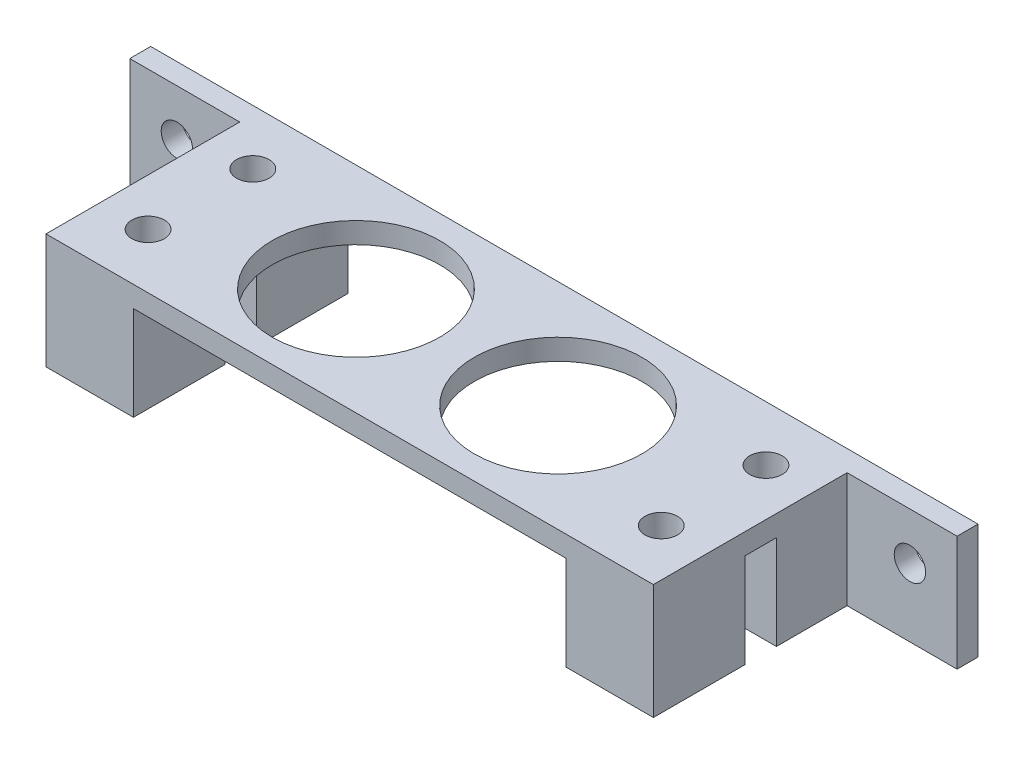
ISO-10303-21;
HEADER;
FILE_DESCRIPTION(('STEP AP214'),'2;1');
FILE_NAME('part.step','',(''),(''),'','','');
FILE_SCHEMA(('AUTOMOTIVE_DESIGN { 1 0 10303 214 1 1 1 1 }'));
ENDSEC;
DATA;
#1=APPLICATION_CONTEXT('core data for automotive mechanical design processes');
#2=APPLICATION_PROTOCOL_DEFINITION('international standard','automotive_design',2000,#1);
#3=PRODUCT_CONTEXT('',#1,'mechanical');
#4=PRODUCT('Part','Part','',(#3));
#5=PRODUCT_RELATED_PRODUCT_CATEGORY('part','',(#4));
#6=PRODUCT_DEFINITION_FORMATION('','',#4);
#7=PRODUCT_DEFINITION_CONTEXT('part definition',#1,'design');
#8=PRODUCT_DEFINITION('design','',#6,#7);
#9=PRODUCT_DEFINITION_SHAPE('','',#8);
#10=(LENGTH_UNIT() NAMED_UNIT(*) SI_UNIT(.MILLI.,.METRE.));
#11=(NAMED_UNIT(*) PLANE_ANGLE_UNIT() SI_UNIT($,.RADIAN.));
#12=(NAMED_UNIT(*) SI_UNIT($,.STERADIAN.) SOLID_ANGLE_UNIT());
#13=UNCERTAINTY_MEASURE_WITH_UNIT(LENGTH_MEASURE(1.E-05),#10,'distance_accuracy_value','');
#14=(GEOMETRIC_REPRESENTATION_CONTEXT(3) GLOBAL_UNCERTAINTY_ASSIGNED_CONTEXT((#13)) GLOBAL_UNIT_ASSIGNED_CONTEXT((#10,
#11,#12)) REPRESENTATION_CONTEXT('',''));
#15=CARTESIAN_POINT('',(0.,0.,0.));
#16=DIRECTION('',(0.,0.,1.));
#17=DIRECTION('',(1.,0.,0.));
#18=AXIS2_PLACEMENT_3D('',#15,#16,#17);
#19=CARTESIAN_POINT('',(-29.,2.,0.));
#20=DIRECTION('',(1.,0.,0.));
#21=DIRECTION('',(0.,0.,-1.));
#22=AXIS2_PLACEMENT_3D('',#19,#20,#21);
#23=PLANE('',#22);
#24=DIRECTION('',(0.,1.,0.));
#25=VECTOR('',#24,1.);
#26=CARTESIAN_POINT('',(-29.,0.,-8.25));
#27=LINE('',#26,#25);
#28=CARTESIAN_POINT('',(-29.,-9.,-8.25));
#29=VERTEX_POINT('',#28);
#30=CARTESIAN_POINT('',(-29.,2.,-8.25));
#31=VERTEX_POINT('',#30);
#32=EDGE_CURVE('E58',#29,#31,#27,.T.);
#33=ORIENTED_EDGE('',*,*,#32,.F.);
#34=DIRECTION('',(0.,0.,-1.));
#35=VECTOR('',#34,1.);
#36=CARTESIAN_POINT('',(-29.,-9.,0.));
#37=LINE('',#36,#35);
#38=CARTESIAN_POINT('',(-29.,-9.,-1.5));
#39=VERTEX_POINT('',#38);
#40=EDGE_CURVE('E338',#39,#29,#37,.T.);
#41=ORIENTED_EDGE('',*,*,#40,.F.);
#42=DIRECTION('',(0.,1.,0.));
#43=VECTOR('',#42,1.);
#44=CARTESIAN_POINT('',(-29.,-9.,-1.5));
#45=LINE('',#44,#43);
#46=CARTESIAN_POINT('',(-29.,0.,-1.5));
#47=VERTEX_POINT('',#46);
#48=EDGE_CURVE('E365',#39,#47,#45,.T.);
#49=ORIENTED_EDGE('',*,*,#48,.T.);
#50=DIRECTION('',(0.,0.,1.));
#51=VECTOR('',#50,1.);
#52=CARTESIAN_POINT('',(-29.,0.,0.));
#53=LINE('',#52,#51);
#54=CARTESIAN_POINT('',(-29.,0.,1.5));
#55=VERTEX_POINT('',#54);
#56=EDGE_CURVE('E452',#47,#55,#53,.T.);
#57=ORIENTED_EDGE('',*,*,#56,.T.);
#58=DIRECTION('',(0.,1.,0.));
#59=VECTOR('',#58,1.);
#60=CARTESIAN_POINT('',(-29.,-9.,1.5));
#61=LINE('',#60,#59);
#62=CARTESIAN_POINT('',(-29.,-9.,1.5));
#63=VERTEX_POINT('',#62);
#64=EDGE_CURVE('E402',#63,#55,#61,.T.);
#65=ORIENTED_EDGE('',*,*,#64,.F.);
#66=DIRECTION('',(0.,0.,-1.));
#67=VECTOR('',#66,1.);
#68=CARTESIAN_POINT('',(-29.,-9.,0.));
#69=LINE('',#68,#67);
#70=CARTESIAN_POINT('',(-29.,-9.,10.25));
#71=VERTEX_POINT('',#70);
#72=EDGE_CURVE('E373',#71,#63,#69,.T.);
#73=ORIENTED_EDGE('',*,*,#72,.F.);
#74=DIRECTION('',(0.,-1.,0.));
#75=VECTOR('',#74,1.);
#76=CARTESIAN_POINT('',(-29.,2.,10.25));
#77=LINE('',#76,#75);
#78=CARTESIAN_POINT('',(-29.,2.,10.25));
#79=VERTEX_POINT('',#78);
#80=EDGE_CURVE('E11',#79,#71,#77,.T.);
#81=ORIENTED_EDGE('',*,*,#80,.F.);
#82=DIRECTION('',(0.,0.,1.));
#83=VECTOR('',#82,1.);
#84=CARTESIAN_POINT('',(-29.,2.,0.));
#85=LINE('',#84,#83);
#86=EDGE_CURVE('E178',#31,#79,#85,.T.);
#87=ORIENTED_EDGE('',*,*,#86,.F.);
#88=EDGE_LOOP('',(#33,#41,#49,#57,#65,#73,#81,#87));
#89=FACE_BOUND('',#88,.T.);
#90=ADVANCED_FACE('F42',(#89),#23,.F.);
#91=CARTESIAN_POINT('',(0.,0.,0.));
#92=DIRECTION('',(0.,1.,0.));
#93=DIRECTION('',(0.,0.,1.));
#94=AXIS2_PLACEMENT_3D('',#91,#92,#93);
#95=PLANE('',#94);
#96=CARTESIAN_POINT('',(-9.65,0.,0.));
#97=DIRECTION('',(0.,1.,0.));
#98=DIRECTION('',(0.,0.,1.));
#99=AXIS2_PLACEMENT_3D('',#96,#97,#98);
#100=CIRCLE('',#99,8.);
#101=CARTESIAN_POINT('',(-9.65,0.,8.));
#102=VERTEX_POINT('',#101);
#103=EDGE_CURVE('E442',#102,#102,#100,.T.);
#104=ORIENTED_EDGE('',*,*,#103,.T.);
#105=EDGE_LOOP('',(#104));
#106=FACE_BOUND('',#105,.T.);
#107=CARTESIAN_POINT('',(9.65,0.,0.));
#108=DIRECTION('',(0.,1.,0.));
#109=DIRECTION('',(0.,0.,1.));
#110=AXIS2_PLACEMENT_3D('',#107,#108,#109);
#111=CIRCLE('',#110,8.);
#112=CARTESIAN_POINT('',(9.65,0.,8.));
#113=VERTEX_POINT('',#112);
#114=EDGE_CURVE('E406',#113,#113,#111,.T.);
#115=ORIENTED_EDGE('',*,*,#114,.T.);
#116=EDGE_LOOP('',(#115));
#117=FACE_BOUND('',#116,.T.);
#118=DIRECTION('',(0.,0.,-1.));
#119=VECTOR('',#118,1.);
#120=CARTESIAN_POINT('',(20.65,0.,0.));
#121=LINE('',#120,#119);
#122=CARTESIAN_POINT('',(20.65,0.,-1.5));
#123=VERTEX_POINT('',#122);
#124=CARTESIAN_POINT('',(20.65,0.,-10.25));
#125=VERTEX_POINT('',#124);
#126=EDGE_CURVE('E267',#123,#125,#121,.T.);
#127=ORIENTED_EDGE('',*,*,#126,.F.);
#128=DIRECTION('',(1.,0.,0.));
#129=VECTOR('',#128,1.);
#130=CARTESIAN_POINT('',(0.,0.,-1.5));
#131=LINE('',#130,#129);
#132=CARTESIAN_POINT('',(29.,0.,-1.5));
#133=VERTEX_POINT('',#132);
#134=EDGE_CURVE('E258',#123,#133,#131,.T.);
#135=ORIENTED_EDGE('',*,*,#134,.T.);
#136=DIRECTION('',(0.,0.,1.));
#137=VECTOR('',#136,1.);
#138=CARTESIAN_POINT('',(29.,0.,0.));
#139=LINE('',#138,#137);
#140=CARTESIAN_POINT('',(29.,0.,1.5));
#141=VERTEX_POINT('',#140);
#142=EDGE_CURVE('E446',#133,#141,#139,.T.);
#143=ORIENTED_EDGE('',*,*,#142,.T.);
#144=DIRECTION('',(1.,0.,0.));
#145=VECTOR('',#144,1.);
#146=CARTESIAN_POINT('',(0.,0.,1.5));
#147=LINE('',#146,#145);
#148=CARTESIAN_POINT('',(20.65,0.,1.5));
#149=VERTEX_POINT('',#148);
#150=EDGE_CURVE('E303',#149,#141,#147,.T.);
#151=ORIENTED_EDGE('',*,*,#150,.F.);
#152=DIRECTION('',(0.,0.,-1.));
#153=VECTOR('',#152,1.);
#154=CARTESIAN_POINT('',(20.65,0.,0.));
#155=LINE('',#154,#153);
#156=CARTESIAN_POINT('',(20.65,0.,10.25));
#157=VERTEX_POINT('',#156);
#158=EDGE_CURVE('E297',#157,#149,#155,.T.);
#159=ORIENTED_EDGE('',*,*,#158,.F.);
#160=DIRECTION('',(1.,0.,0.));
#161=VECTOR('',#160,1.);
#162=CARTESIAN_POINT('',(0.,0.,10.25));
#163=LINE('',#162,#161);
#164=CARTESIAN_POINT('',(-20.65,0.,10.25));
#165=VERTEX_POINT('',#164);
#166=EDGE_CURVE('E412',#165,#157,#163,.T.);
#167=ORIENTED_EDGE('',*,*,#166,.F.);
#168=DIRECTION('',(0.,0.,-1.));
#169=VECTOR('',#168,1.);
#170=CARTESIAN_POINT('',(-20.65,0.,0.));
#171=LINE('',#170,#169);
#172=CARTESIAN_POINT('',(-20.65,0.,1.5));
#173=VERTEX_POINT('',#172);
#174=EDGE_CURVE('E374',#165,#173,#171,.T.);
#175=ORIENTED_EDGE('',*,*,#174,.T.);
#176=DIRECTION('',(1.,0.,0.));
#177=VECTOR('',#176,1.);
#178=CARTESIAN_POINT('',(0.,0.,1.5));
#179=LINE('',#178,#177);
#180=EDGE_CURVE('E368',#55,#173,#179,.T.);
#181=ORIENTED_EDGE('',*,*,#180,.F.);
#182=ORIENTED_EDGE('',*,*,#56,.F.);
#183=DIRECTION('',(1.,0.,0.));
#184=VECTOR('',#183,1.);
#185=CARTESIAN_POINT('',(0.,0.,-1.5));
#186=LINE('',#185,#184);
#187=CARTESIAN_POINT('',(-20.65,0.,-1.5));
#188=VERTEX_POINT('',#187);
#189=EDGE_CURVE('E333',#47,#188,#186,.T.);
#190=ORIENTED_EDGE('',*,*,#189,.T.);
#191=DIRECTION('',(0.,0.,-1.));
#192=VECTOR('',#191,1.);
#193=CARTESIAN_POINT('',(-20.65,0.,0.));
#194=LINE('',#193,#192);
#195=CARTESIAN_POINT('',(-20.65,0.,-10.25));
#196=VERTEX_POINT('',#195);
#197=EDGE_CURVE('E339',#188,#196,#194,.T.);
#198=ORIENTED_EDGE('',*,*,#197,.T.);
#199=DIRECTION('',(1.,0.,0.));
#200=VECTOR('',#199,1.);
#201=CARTESIAN_POINT('',(0.,0.,-10.25));
#202=LINE('',#201,#200);
#203=EDGE_CURVE('E449',#196,#125,#202,.T.);
#204=ORIENTED_EDGE('',*,*,#203,.T.);
#205=EDGE_LOOP('',(#127,#135,#143,#151,#159,#167,#175,#181,#182,#190,#198,#204));
#206=FACE_BOUND('',#205,.T.);
#207=ADVANCED_FACE('F508',(#106,#117,#206),#95,.F.);
#208=CARTESIAN_POINT('',(29.,2.,0.));
#209=DIRECTION('',(1.,0.,0.));
#210=DIRECTION('',(0.,0.,-1.));
#211=AXIS2_PLACEMENT_3D('',#208,#209,#210);
#212=PLANE('',#211);
#213=DIRECTION('',(0.,-1.,0.));
#214=VECTOR('',#213,1.);
#215=CARTESIAN_POINT('',(29.,0.,-8.25));
#216=LINE('',#215,#214);
#217=CARTESIAN_POINT('',(29.,2.,-8.25));
#218=VERTEX_POINT('',#217);
#219=CARTESIAN_POINT('',(29.,-9.,-8.25));
#220=VERTEX_POINT('',#219);
#221=EDGE_CURVE('E66',#218,#220,#216,.T.);
#222=ORIENTED_EDGE('',*,*,#221,.F.);
#223=DIRECTION('',(0.,0.,1.));
#224=VECTOR('',#223,1.);
#225=CARTESIAN_POINT('',(29.,2.,0.));
#226=LINE('',#225,#224);
#227=CARTESIAN_POINT('',(29.,2.,10.25));
#228=VERTEX_POINT('',#227);
#229=EDGE_CURVE('E432',#218,#228,#226,.T.);
#230=ORIENTED_EDGE('',*,*,#229,.T.);
#231=DIRECTION('',(0.,-1.,0.));
#232=VECTOR('',#231,1.);
#233=CARTESIAN_POINT('',(29.,2.,10.25));
#234=LINE('',#233,#232);
#235=CARTESIAN_POINT('',(29.,-9.,10.25));
#236=VERTEX_POINT('',#235);
#237=EDGE_CURVE('E51',#228,#236,#234,.T.);
#238=ORIENTED_EDGE('',*,*,#237,.T.);
#239=DIRECTION('',(0.,0.,1.));
#240=VECTOR('',#239,1.);
#241=CARTESIAN_POINT('',(29.,-9.,0.));
#242=LINE('',#241,#240);
#243=CARTESIAN_POINT('',(29.,-9.,1.5));
#244=VERTEX_POINT('',#243);
#245=EDGE_CURVE('E310',#244,#236,#242,.T.);
#246=ORIENTED_EDGE('',*,*,#245,.F.);
#247=DIRECTION('',(0.,1.,0.));
#248=VECTOR('',#247,1.);
#249=CARTESIAN_POINT('',(29.,-9.,1.5));
#250=LINE('',#249,#248);
#251=EDGE_CURVE('E326',#244,#141,#250,.T.);
#252=ORIENTED_EDGE('',*,*,#251,.T.);
#253=ORIENTED_EDGE('',*,*,#142,.F.);
#254=DIRECTION('',(0.,1.,0.));
#255=VECTOR('',#254,1.);
#256=CARTESIAN_POINT('',(29.,-9.,-1.5));
#257=LINE('',#256,#255);
#258=CARTESIAN_POINT('',(29.,-9.,-1.5));
#259=VERTEX_POINT('',#258);
#260=EDGE_CURVE('E280',#259,#133,#257,.T.);
#261=ORIENTED_EDGE('',*,*,#260,.F.);
#262=DIRECTION('',(0.,0.,1.));
#263=VECTOR('',#262,1.);
#264=CARTESIAN_POINT('',(29.,-9.,0.));
#265=LINE('',#264,#263);
#266=EDGE_CURVE('E273',#220,#259,#265,.T.);
#267=ORIENTED_EDGE('',*,*,#266,.F.);
#268=EDGE_LOOP('',(#222,#230,#238,#246,#252,#253,#261,#267));
#269=FACE_BOUND('',#268,.T.);
#270=ADVANCED_FACE('F460',(#269),#212,.T.);
#271=CARTESIAN_POINT('',(0.,2.,-10.25));
#272=DIRECTION('',(0.,0.,-1.));
#273=DIRECTION('',(-1.,0.,0.));
#274=AXIS2_PLACEMENT_3D('',#271,#272,#273);
#275=PLANE('',#274);
#276=ORIENTED_EDGE('',*,*,#203,.F.);
#277=DIRECTION('',(0.,1.,0.));
#278=VECTOR('',#277,1.);
#279=CARTESIAN_POINT('',(-20.65,-9.,-10.25));
#280=LINE('',#279,#278);
#281=CARTESIAN_POINT('',(-20.65,-9.,-10.25));
#282=VERTEX_POINT('',#281);
#283=EDGE_CURVE('E362',#282,#196,#280,.T.);
#284=ORIENTED_EDGE('',*,*,#283,.F.);
#285=DIRECTION('',(1.,0.,0.));
#286=VECTOR('',#285,1.);
#287=CARTESIAN_POINT('',(0.,-9.,-10.25));
#288=LINE('',#287,#286);
#289=CARTESIAN_POINT('',(-39.5,-9.,-10.25));
#290=VERTEX_POINT('',#289);
#291=EDGE_CURVE('E342',#290,#282,#288,.T.);
#292=ORIENTED_EDGE('',*,*,#291,.F.);
#293=DIRECTION('',(0.,-1.,0.));
#294=VECTOR('',#293,1.);
#295=CARTESIAN_POINT('',(-39.5,0.,-10.25));
#296=LINE('',#295,#294);
#297=CARTESIAN_POINT('',(-39.5,2.,-10.25));
#298=VERTEX_POINT('',#297);
#299=EDGE_CURVE('E207',#298,#290,#296,.T.);
#300=ORIENTED_EDGE('',*,*,#299,.F.);
#301=DIRECTION('',(1.,0.,0.));
#302=VECTOR('',#301,1.);
#303=CARTESIAN_POINT('',(0.,2.,-10.25));
#304=LINE('',#303,#302);
#305=CARTESIAN_POINT('',(39.5,2.,-10.25));
#306=VERTEX_POINT('',#305);
#307=EDGE_CURVE('E186',#298,#306,#304,.T.);
#308=ORIENTED_EDGE('',*,*,#307,.T.);
#309=DIRECTION('',(0.,-1.,0.));
#310=VECTOR('',#309,1.);
#311=CARTESIAN_POINT('',(39.5,0.,-10.25));
#312=LINE('',#311,#310);
#313=CARTESIAN_POINT('',(39.5,-9.00000000000002,-10.25));
#314=VERTEX_POINT('',#313);
#315=EDGE_CURVE('E234',#306,#314,#312,.T.);
#316=ORIENTED_EDGE('',*,*,#315,.T.);
#317=DIRECTION('',(1.,0.,0.));
#318=VECTOR('',#317,1.);
#319=CARTESIAN_POINT('',(0.,-9.,-10.25));
#320=LINE('',#319,#318);
#321=CARTESIAN_POINT('',(20.65,-9.,-10.25));
#322=VERTEX_POINT('',#321);
#323=EDGE_CURVE('E270',#322,#314,#320,.T.);
#324=ORIENTED_EDGE('',*,*,#323,.F.);
#325=DIRECTION('',(0.,1.,0.));
#326=VECTOR('',#325,1.);
#327=CARTESIAN_POINT('',(20.65,-9.,-10.25));
#328=LINE('',#327,#326);
#329=EDGE_CURVE('E289',#322,#125,#328,.T.);
#330=ORIENTED_EDGE('',*,*,#329,.T.);
#331=EDGE_LOOP('',(#276,#284,#292,#300,#308,#316,#324,#330));
#332=FACE_BOUND('',#331,.T.);
#333=CARTESIAN_POINT('',(35.,-2.5,-10.25));
#334=DIRECTION('',(0.,0.,-1.));
#335=DIRECTION('',(-1.,0.,0.));
#336=AXIS2_PLACEMENT_3D('',#333,#334,#335);
#337=CIRCLE('',#336,1.5);
#338=CARTESIAN_POINT('',(33.5,-2.5,-10.25));
#339=VERTEX_POINT('',#338);
#340=EDGE_CURVE('E225',#339,#339,#337,.T.);
#341=ORIENTED_EDGE('',*,*,#340,.F.);
#342=EDGE_LOOP('',(#341));
#343=FACE_BOUND('',#342,.T.);
#344=CARTESIAN_POINT('',(-35.,-2.5,-10.25));
#345=DIRECTION('',(0.,0.,-1.));
#346=DIRECTION('',(-1.,0.,0.));
#347=AXIS2_PLACEMENT_3D('',#344,#345,#346);
#348=CIRCLE('',#347,1.5);
#349=CARTESIAN_POINT('',(-36.5,-2.5,-10.25));
#350=VERTEX_POINT('',#349);
#351=EDGE_CURVE('E203',#350,#350,#348,.T.);
#352=ORIENTED_EDGE('',*,*,#351,.F.);
#353=EDGE_LOOP('',(#352));
#354=FACE_BOUND('',#353,.T.);
#355=ADVANCED_FACE('F520',(#332,#343,#354),#275,.T.);
#356=CARTESIAN_POINT('',(-9.65,2.,0.));
#357=DIRECTION('',(0.,-1.,0.));
#358=DIRECTION('',(0.,0.,-1.));
#359=AXIS2_PLACEMENT_3D('',#356,#357,#358);
#360=CYLINDRICAL_SURFACE('',#359,8.);
#361=CARTESIAN_POINT('',(-9.65,2.,0.));
#362=DIRECTION('',(0.,1.,0.));
#363=DIRECTION('',(0.,0.,1.));
#364=AXIS2_PLACEMENT_3D('',#361,#362,#363);
#365=CIRCLE('',#364,8.);
#366=CARTESIAN_POINT('',(-9.65,2.,8.));
#367=VERTEX_POINT('',#366);
#368=EDGE_CURVE('E428',#367,#367,#365,.T.);
#369=ORIENTED_EDGE('',*,*,#368,.T.);
#370=EDGE_LOOP('',(#369));
#371=FACE_BOUND('',#370,.T.);
#372=ORIENTED_EDGE('',*,*,#103,.F.);
#373=EDGE_LOOP('',(#372));
#374=FACE_BOUND('',#373,.T.);
#375=ADVANCED_FACE('F551',(#371,#374),#360,.F.);
#376=CARTESIAN_POINT('',(-24.5,2.,-5.));
#377=DIRECTION('',(0.,-1.,0.));
#378=DIRECTION('',(0.,0.,-1.));
#379=AXIS2_PLACEMENT_3D('',#376,#377,#378);
#380=CYLINDRICAL_SURFACE('',#379,1.55);
#381=CARTESIAN_POINT('',(-24.5,2.,-5.));
#382=DIRECTION('',(0.,1.,0.));
#383=DIRECTION('',(0.,0.,1.));
#384=AXIS2_PLACEMENT_3D('',#381,#382,#383);
#385=CIRCLE('',#384,1.55);
#386=CARTESIAN_POINT('',(-24.5,2.,-3.45));
#387=VERTEX_POINT('',#386);
#388=EDGE_CURVE('E424',#387,#387,#385,.T.);
#389=ORIENTED_EDGE('',*,*,#388,.T.);
#390=EDGE_LOOP('',(#389));
#391=FACE_BOUND('',#390,.T.);
#392=CARTESIAN_POINT('',(-24.5,-9.,-5.));
#393=DIRECTION('',(0.,-1.,0.));
#394=DIRECTION('',(0.,0.,-1.));
#395=AXIS2_PLACEMENT_3D('',#392,#393,#394);
#396=CIRCLE('',#395,1.55);
#397=CARTESIAN_POINT('',(-24.5,-9.,-6.55));
#398=VERTEX_POINT('',#397);
#399=EDGE_CURVE('E349',#398,#398,#396,.F.);
#400=ORIENTED_EDGE('',*,*,#399,.F.);
#401=EDGE_LOOP('',(#400));
#402=FACE_BOUND('',#401,.T.);
#403=ADVANCED_FACE('F556',(#391,#402),#380,.F.);
#404=CARTESIAN_POINT('',(-24.5,2.,5.));
#405=DIRECTION('',(0.,-1.,0.));
#406=DIRECTION('',(0.,0.,-1.));
#407=AXIS2_PLACEMENT_3D('',#404,#405,#406);
#408=CYLINDRICAL_SURFACE('',#407,1.55);
#409=CARTESIAN_POINT('',(-24.5,2.,5.));
#410=DIRECTION('',(0.,1.,0.));
#411=DIRECTION('',(0.,0.,1.));
#412=AXIS2_PLACEMENT_3D('',#409,#410,#411);
#413=CIRCLE('',#412,1.55);
#414=CARTESIAN_POINT('',(-24.5,2.,6.55));
#415=VERTEX_POINT('',#414);
#416=EDGE_CURVE('E420',#415,#415,#413,.T.);
#417=ORIENTED_EDGE('',*,*,#416,.T.);
#418=EDGE_LOOP('',(#417));
#419=FACE_BOUND('',#418,.T.);
#420=CARTESIAN_POINT('',(-24.5,-9.,5.));
#421=DIRECTION('',(0.,-1.,0.));
#422=DIRECTION('',(0.,0.,-1.));
#423=AXIS2_PLACEMENT_3D('',#420,#421,#422);
#424=CIRCLE('',#423,1.55);
#425=CARTESIAN_POINT('',(-24.5,-9.,3.45));
#426=VERTEX_POINT('',#425);
#427=EDGE_CURVE('E369',#426,#426,#424,.F.);
#428=ORIENTED_EDGE('',*,*,#427,.F.);
#429=EDGE_LOOP('',(#428));
#430=FACE_BOUND('',#429,.T.);
#431=ADVANCED_FACE('F560',(#419,#430),#408,.F.);
#432=CARTESIAN_POINT('',(24.5,2.,-5.00000000000001));
#433=DIRECTION('',(0.,-1.,0.));
#434=DIRECTION('',(0.,0.,-1.));
#435=AXIS2_PLACEMENT_3D('',#432,#433,#434);
#436=CYLINDRICAL_SURFACE('',#435,1.55);
#437=CARTESIAN_POINT('',(24.5,2.,-5.00000000000001));
#438=DIRECTION('',(0.,1.,0.));
#439=DIRECTION('',(0.,0.,1.));
#440=AXIS2_PLACEMENT_3D('',#437,#438,#439);
#441=CIRCLE('',#440,1.55);
#442=CARTESIAN_POINT('',(24.5,2.,-3.45000000000001));
#443=VERTEX_POINT('',#442);
#444=EDGE_CURVE('E416',#443,#443,#441,.T.);
#445=ORIENTED_EDGE('',*,*,#444,.T.);
#446=EDGE_LOOP('',(#445));
#447=FACE_BOUND('',#446,.T.);
#448=CARTESIAN_POINT('',(24.5,-9.,-5.00000000000001));
#449=DIRECTION('',(0.,-1.,0.));
#450=DIRECTION('',(0.,0.,-1.));
#451=AXIS2_PLACEMENT_3D('',#448,#449,#450);
#452=CIRCLE('',#451,1.55);
#453=CARTESIAN_POINT('',(24.5,-9.,-6.55000000000001));
#454=VERTEX_POINT('',#453);
#455=EDGE_CURVE('E276',#454,#454,#452,.F.);
#456=ORIENTED_EDGE('',*,*,#455,.F.);
#457=EDGE_LOOP('',(#456));
#458=FACE_BOUND('',#457,.T.);
#459=ADVANCED_FACE('F564',(#447,#458),#436,.F.);
#460=CARTESIAN_POINT('',(24.5,2.,5.00000000000001));
#461=DIRECTION('',(0.,-1.,0.));
#462=DIRECTION('',(0.,0.,-1.));
#463=AXIS2_PLACEMENT_3D('',#460,#461,#462);
#464=CYLINDRICAL_SURFACE('',#463,1.55);
#465=CARTESIAN_POINT('',(24.5,2.,5.00000000000001));
#466=DIRECTION('',(0.,1.,0.));
#467=DIRECTION('',(0.,0.,1.));
#468=AXIS2_PLACEMENT_3D('',#465,#466,#467);
#469=CIRCLE('',#468,1.55);
#470=CARTESIAN_POINT('',(24.5,2.,6.55000000000001));
#471=VERTEX_POINT('',#470);
#472=EDGE_CURVE('E411',#471,#471,#469,.T.);
#473=ORIENTED_EDGE('',*,*,#472,.T.);
#474=EDGE_LOOP('',(#473));
#475=FACE_BOUND('',#474,.T.);
#476=CARTESIAN_POINT('',(24.5,-9.,5.00000000000001));
#477=DIRECTION('',(0.,-1.,0.));
#478=DIRECTION('',(0.,0.,-1.));
#479=AXIS2_PLACEMENT_3D('',#476,#477,#478);
#480=CIRCLE('',#479,1.55);
#481=CARTESIAN_POINT('',(24.5,-9.,3.45000000000001));
#482=VERTEX_POINT('',#481);
#483=EDGE_CURVE('E298',#482,#482,#480,.F.);
#484=ORIENTED_EDGE('',*,*,#483,.F.);
#485=EDGE_LOOP('',(#484));
#486=FACE_BOUND('',#485,.T.);
#487=ADVANCED_FACE('F567',(#475,#486),#464,.F.);
#488=CARTESIAN_POINT('',(9.65,2.,0.));
#489=DIRECTION('',(0.,-1.,0.));
#490=DIRECTION('',(0.,0.,-1.));
#491=AXIS2_PLACEMENT_3D('',#488,#489,#490);
#492=CYLINDRICAL_SURFACE('',#491,8.);
#493=CARTESIAN_POINT('',(9.65,2.,0.));
#494=DIRECTION('',(0.,1.,0.));
#495=DIRECTION('',(0.,0.,1.));
#496=AXIS2_PLACEMENT_3D('',#493,#494,#495);
#497=CIRCLE('',#496,8.);
#498=CARTESIAN_POINT('',(9.65,2.,8.));
#499=VERTEX_POINT('',#498);
#500=EDGE_CURVE('E407',#499,#499,#497,.T.);
#501=ORIENTED_EDGE('',*,*,#500,.T.);
#502=EDGE_LOOP('',(#501));
#503=FACE_BOUND('',#502,.T.);
#504=ORIENTED_EDGE('',*,*,#114,.F.);
#505=EDGE_LOOP('',(#504));
#506=FACE_BOUND('',#505,.T.);
#507=ADVANCED_FACE('F44',(#503,#506),#492,.F.);
#508=CARTESIAN_POINT('',(0.,2.,10.25));
#509=DIRECTION('',(0.,0.,-1.));
#510=DIRECTION('',(-1.,0.,0.));
#511=AXIS2_PLACEMENT_3D('',#508,#509,#510);
#512=PLANE('',#511);
#513=ORIENTED_EDGE('',*,*,#80,.T.);
#514=DIRECTION('',(-1.,0.,0.));
#515=VECTOR('',#514,1.);
#516=CARTESIAN_POINT('',(0.,-9.,10.25));
#517=LINE('',#516,#515);
#518=CARTESIAN_POINT('',(-20.65,-9.,10.25));
#519=VERTEX_POINT('',#518);
#520=EDGE_CURVE('E385',#519,#71,#517,.T.);
#521=ORIENTED_EDGE('',*,*,#520,.F.);
#522=DIRECTION('',(0.,1.,0.));
#523=VECTOR('',#522,1.);
#524=CARTESIAN_POINT('',(-20.65,-9.,10.25));
#525=LINE('',#524,#523);
#526=EDGE_CURVE('E389',#519,#165,#525,.T.);
#527=ORIENTED_EDGE('',*,*,#526,.T.);
#528=ORIENTED_EDGE('',*,*,#166,.T.);
#529=DIRECTION('',(0.,1.,0.));
#530=VECTOR('',#529,1.);
#531=CARTESIAN_POINT('',(20.65,-9.,10.25));
#532=LINE('',#531,#530);
#533=CARTESIAN_POINT('',(20.65,-9.,10.25));
#534=VERTEX_POINT('',#533);
#535=EDGE_CURVE('E317',#534,#157,#532,.T.);
#536=ORIENTED_EDGE('',*,*,#535,.F.);
#537=DIRECTION('',(-1.,0.,0.));
#538=VECTOR('',#537,1.);
#539=CARTESIAN_POINT('',(0.,-9.,10.25));
#540=LINE('',#539,#538);
#541=EDGE_CURVE('E314',#236,#534,#540,.T.);
#542=ORIENTED_EDGE('',*,*,#541,.F.);
#543=ORIENTED_EDGE('',*,*,#237,.F.);
#544=DIRECTION('',(1.,0.,0.));
#545=VECTOR('',#544,1.);
#546=CARTESIAN_POINT('',(0.,2.,10.25));
#547=LINE('',#546,#545);
#548=EDGE_CURVE('E185',#79,#228,#547,.T.);
#549=ORIENTED_EDGE('',*,*,#548,.F.);
#550=EDGE_LOOP('',(#513,#521,#527,#528,#536,#542,#543,#549));
#551=FACE_BOUND('',#550,.T.);
#552=ADVANCED_FACE('F467',(#551),#512,.F.);
#553=CARTESIAN_POINT('',(0.,2.,0.));
#554=DIRECTION('',(0.,1.,0.));
#555=DIRECTION('',(0.,0.,1.));
#556=AXIS2_PLACEMENT_3D('',#553,#554,#555);
#557=PLANE('',#556);
#558=ORIENTED_EDGE('',*,*,#500,.F.);
#559=EDGE_LOOP('',(#558));
#560=FACE_BOUND('',#559,.T.);
#561=ORIENTED_EDGE('',*,*,#472,.F.);
#562=EDGE_LOOP('',(#561));
#563=FACE_BOUND('',#562,.T.);
#564=ORIENTED_EDGE('',*,*,#444,.F.);
#565=EDGE_LOOP('',(#564));
#566=FACE_BOUND('',#565,.T.);
#567=ORIENTED_EDGE('',*,*,#416,.F.);
#568=EDGE_LOOP('',(#567));
#569=FACE_BOUND('',#568,.T.);
#570=ORIENTED_EDGE('',*,*,#388,.F.);
#571=EDGE_LOOP('',(#570));
#572=FACE_BOUND('',#571,.T.);
#573=ORIENTED_EDGE('',*,*,#368,.F.);
#574=EDGE_LOOP('',(#573));
#575=FACE_BOUND('',#574,.T.);
#576=ORIENTED_EDGE('',*,*,#229,.F.);
#577=DIRECTION('',(1.,0.,0.));
#578=VECTOR('',#577,1.);
#579=CARTESIAN_POINT('',(0.,2.,-8.25));
#580=LINE('',#579,#578);
#581=CARTESIAN_POINT('',(39.5,2.,-8.25));
#582=VERTEX_POINT('',#581);
#583=EDGE_CURVE('E233',#218,#582,#580,.T.);
#584=ORIENTED_EDGE('',*,*,#583,.T.);
#585=DIRECTION('',(0.,0.,-1.));
#586=VECTOR('',#585,1.);
#587=CARTESIAN_POINT('',(39.5,2.,-8.25));
#588=LINE('',#587,#586);
#589=EDGE_CURVE('E247',#582,#306,#588,.T.);
#590=ORIENTED_EDGE('',*,*,#589,.T.);
#591=ORIENTED_EDGE('',*,*,#307,.F.);
#592=DIRECTION('',(0.,0.,-1.));
#593=VECTOR('',#592,1.);
#594=CARTESIAN_POINT('',(-39.5,2.,-8.25));
#595=LINE('',#594,#593);
#596=CARTESIAN_POINT('',(-39.5,2.,-8.25));
#597=VERTEX_POINT('',#596);
#598=EDGE_CURVE('E200',#597,#298,#595,.T.);
#599=ORIENTED_EDGE('',*,*,#598,.F.);
#600=DIRECTION('',(1.,0.,0.));
#601=VECTOR('',#600,1.);
#602=CARTESIAN_POINT('',(0.,2.,-8.25));
#603=LINE('',#602,#601);
#604=EDGE_CURVE('E193',#597,#31,#603,.T.);
#605=ORIENTED_EDGE('',*,*,#604,.T.);
#606=ORIENTED_EDGE('',*,*,#86,.T.);
#607=ORIENTED_EDGE('',*,*,#548,.T.);
#608=EDGE_LOOP('',(#576,#584,#590,#591,#599,#605,#606,#607));
#609=FACE_BOUND('',#608,.T.);
#610=ADVANCED_FACE('F198',(#560,#563,#566,#569,#572,#575,#609),#557,.T.);
#611=CARTESIAN_POINT('',(0.,-9.,1.5));
#612=DIRECTION('',(0.,0.,1.));
#613=DIRECTION('',(1.,0.,0.));
#614=AXIS2_PLACEMENT_3D('',#611,#612,#613);
#615=PLANE('',#614);
#616=ORIENTED_EDGE('',*,*,#180,.T.);
#617=DIRECTION('',(0.,1.,0.));
#618=VECTOR('',#617,1.);
#619=CARTESIAN_POINT('',(-20.65,-9.,1.5));
#620=LINE('',#619,#618);
#621=CARTESIAN_POINT('',(-20.65,-9.,1.5));
#622=VERTEX_POINT('',#621);
#623=EDGE_CURVE('E398',#622,#173,#620,.T.);
#624=ORIENTED_EDGE('',*,*,#623,.F.);
#625=DIRECTION('',(1.,0.,0.));
#626=VECTOR('',#625,1.);
#627=CARTESIAN_POINT('',(0.,-9.,1.5));
#628=LINE('',#627,#626);
#629=EDGE_CURVE('E378',#63,#622,#628,.T.);
#630=ORIENTED_EDGE('',*,*,#629,.F.);
#631=ORIENTED_EDGE('',*,*,#64,.T.);
#632=EDGE_LOOP('',(#616,#624,#630,#631));
#633=FACE_BOUND('',#632,.T.);
#634=ADVANCED_FACE('F503',(#633),#615,.F.);
#635=CARTESIAN_POINT('',(-20.65,-9.,0.));
#636=DIRECTION('',(1.,0.,0.));
#637=DIRECTION('',(0.,0.,-1.));
#638=AXIS2_PLACEMENT_3D('',#635,#636,#637);
#639=PLANE('',#638);
#640=ORIENTED_EDGE('',*,*,#174,.F.);
#641=ORIENTED_EDGE('',*,*,#526,.F.);
#642=DIRECTION('',(0.,0.,-1.));
#643=VECTOR('',#642,1.);
#644=CARTESIAN_POINT('',(-20.65,-9.,0.));
#645=LINE('',#644,#643);
#646=EDGE_CURVE('E381',#519,#622,#645,.T.);
#647=ORIENTED_EDGE('',*,*,#646,.T.);
#648=ORIENTED_EDGE('',*,*,#623,.T.);
#649=EDGE_LOOP('',(#640,#641,#647,#648));
#650=FACE_BOUND('',#649,.T.);
#651=ADVANCED_FACE('F507',(#650),#639,.T.);
#652=CARTESIAN_POINT('',(0.,-9.,0.));
#653=DIRECTION('',(0.,-1.,0.));
#654=DIRECTION('',(0.,0.,-1.));
#655=AXIS2_PLACEMENT_3D('',#652,#653,#654);
#656=PLANE('',#655);
#657=ORIENTED_EDGE('',*,*,#427,.T.);
#658=EDGE_LOOP('',(#657));
#659=FACE_BOUND('',#658,.T.);
#660=ORIENTED_EDGE('',*,*,#72,.T.);
#661=ORIENTED_EDGE('',*,*,#629,.T.);
#662=ORIENTED_EDGE('',*,*,#646,.F.);
#663=ORIENTED_EDGE('',*,*,#520,.T.);
#664=EDGE_LOOP('',(#660,#661,#662,#663));
#665=FACE_BOUND('',#664,.T.);
#666=ADVANCED_FACE('F498',(#659,#665),#656,.T.);
#667=CARTESIAN_POINT('',(0.,-9.,-1.5));
#668=DIRECTION('',(0.,0.,1.));
#669=DIRECTION('',(1.,0.,0.));
#670=AXIS2_PLACEMENT_3D('',#667,#668,#669);
#671=PLANE('',#670);
#672=ORIENTED_EDGE('',*,*,#189,.F.);
#673=ORIENTED_EDGE('',*,*,#48,.F.);
#674=DIRECTION('',(1.,0.,0.));
#675=VECTOR('',#674,1.);
#676=CARTESIAN_POINT('',(0.,-9.,-1.5));
#677=LINE('',#676,#675);
#678=CARTESIAN_POINT('',(-20.65,-9.,-1.5));
#679=VERTEX_POINT('',#678);
#680=EDGE_CURVE('E334',#39,#679,#677,.T.);
#681=ORIENTED_EDGE('',*,*,#680,.T.);
#682=DIRECTION('',(0.,1.,0.));
#683=VECTOR('',#682,1.);
#684=CARTESIAN_POINT('',(-20.65,-9.,-1.5));
#685=LINE('',#684,#683);
#686=EDGE_CURVE('E353',#679,#188,#685,.T.);
#687=ORIENTED_EDGE('',*,*,#686,.T.);
#688=EDGE_LOOP('',(#672,#673,#681,#687));
#689=FACE_BOUND('',#688,.T.);
#690=ADVANCED_FACE('F513',(#689),#671,.T.);
#691=CARTESIAN_POINT('',(-20.65,-9.,0.));
#692=DIRECTION('',(1.,0.,0.));
#693=DIRECTION('',(0.,0.,-1.));
#694=AXIS2_PLACEMENT_3D('',#691,#692,#693);
#695=PLANE('',#694);
#696=ORIENTED_EDGE('',*,*,#197,.F.);
#697=ORIENTED_EDGE('',*,*,#686,.F.);
#698=DIRECTION('',(0.,0.,-1.));
#699=VECTOR('',#698,1.);
#700=CARTESIAN_POINT('',(-20.65,-9.,0.));
#701=LINE('',#700,#699);
#702=EDGE_CURVE('E345',#679,#282,#701,.T.);
#703=ORIENTED_EDGE('',*,*,#702,.T.);
#704=ORIENTED_EDGE('',*,*,#283,.T.);
#705=EDGE_LOOP('',(#696,#697,#703,#704));
#706=FACE_BOUND('',#705,.T.);
#707=ADVANCED_FACE('F517',(#706),#695,.T.);
#708=CARTESIAN_POINT('',(0.,-9.,0.));
#709=DIRECTION('',(0.,-1.,0.));
#710=DIRECTION('',(0.,0.,-1.));
#711=AXIS2_PLACEMENT_3D('',#708,#709,#710);
#712=PLANE('',#711);
#713=ORIENTED_EDGE('',*,*,#680,.F.);
#714=ORIENTED_EDGE('',*,*,#40,.T.);
#715=DIRECTION('',(1.,0.,0.));
#716=VECTOR('',#715,1.);
#717=CARTESIAN_POINT('',(0.,-9.00000000000001,-8.25));
#718=LINE('',#717,#716);
#719=CARTESIAN_POINT('',(-39.5,-9.,-8.25));
#720=VERTEX_POINT('',#719);
#721=EDGE_CURVE('E195',#720,#29,#718,.T.);
#722=ORIENTED_EDGE('',*,*,#721,.F.);
#723=DIRECTION('',(0.,0.,-1.));
#724=VECTOR('',#723,1.);
#725=CARTESIAN_POINT('',(-39.5,-9.,-8.25));
#726=LINE('',#725,#724);
#727=EDGE_CURVE('E219',#720,#290,#726,.T.);
#728=ORIENTED_EDGE('',*,*,#727,.T.);
#729=ORIENTED_EDGE('',*,*,#291,.T.);
#730=ORIENTED_EDGE('',*,*,#702,.F.);
#731=EDGE_LOOP('',(#713,#714,#722,#728,#729,#730));
#732=FACE_BOUND('',#731,.T.);
#733=ORIENTED_EDGE('',*,*,#399,.T.);
#734=EDGE_LOOP('',(#733));
#735=FACE_BOUND('',#734,.T.);
#736=ADVANCED_FACE('F591',(#732,#735),#712,.T.);
#737=CARTESIAN_POINT('',(20.65,-9.,0.));
#738=DIRECTION('',(1.,0.,0.));
#739=DIRECTION('',(0.,0.,-1.));
#740=AXIS2_PLACEMENT_3D('',#737,#738,#739);
#741=PLANE('',#740);
#742=ORIENTED_EDGE('',*,*,#158,.T.);
#743=DIRECTION('',(0.,1.,0.));
#744=VECTOR('',#743,1.);
#745=CARTESIAN_POINT('',(20.65,-9.,1.5));
#746=LINE('',#745,#744);
#747=CARTESIAN_POINT('',(20.65,-9.,1.5));
#748=VERTEX_POINT('',#747);
#749=EDGE_CURVE('E330',#748,#149,#746,.T.);
#750=ORIENTED_EDGE('',*,*,#749,.F.);
#751=DIRECTION('',(0.,0.,-1.));
#752=VECTOR('',#751,1.);
#753=CARTESIAN_POINT('',(20.65,-9.,0.));
#754=LINE('',#753,#752);
#755=EDGE_CURVE('E302',#534,#748,#754,.T.);
#756=ORIENTED_EDGE('',*,*,#755,.F.);
#757=ORIENTED_EDGE('',*,*,#535,.T.);
#758=EDGE_LOOP('',(#742,#750,#756,#757));
#759=FACE_BOUND('',#758,.T.);
#760=ADVANCED_FACE('F472',(#759),#741,.F.);
#761=CARTESIAN_POINT('',(0.,-9.,1.5));
#762=DIRECTION('',(0.,0.,1.));
#763=DIRECTION('',(1.,0.,0.));
#764=AXIS2_PLACEMENT_3D('',#761,#762,#763);
#765=PLANE('',#764);
#766=ORIENTED_EDGE('',*,*,#150,.T.);
#767=ORIENTED_EDGE('',*,*,#251,.F.);
#768=DIRECTION('',(1.,0.,0.));
#769=VECTOR('',#768,1.);
#770=CARTESIAN_POINT('',(0.,-9.,1.5));
#771=LINE('',#770,#769);
#772=EDGE_CURVE('E307',#748,#244,#771,.T.);
#773=ORIENTED_EDGE('',*,*,#772,.F.);
#774=ORIENTED_EDGE('',*,*,#749,.T.);
#775=EDGE_LOOP('',(#766,#767,#773,#774));
#776=FACE_BOUND('',#775,.T.);
#777=ADVANCED_FACE('F475',(#776),#765,.F.);
#778=CARTESIAN_POINT('',(0.,-9.,0.));
#779=DIRECTION('',(0.,-1.,0.));
#780=DIRECTION('',(0.,0.,-1.));
#781=AXIS2_PLACEMENT_3D('',#778,#779,#780);
#782=PLANE('',#781);
#783=ORIENTED_EDGE('',*,*,#483,.T.);
#784=EDGE_LOOP('',(#783));
#785=FACE_BOUND('',#784,.T.);
#786=ORIENTED_EDGE('',*,*,#755,.T.);
#787=ORIENTED_EDGE('',*,*,#772,.T.);
#788=ORIENTED_EDGE('',*,*,#245,.T.);
#789=ORIENTED_EDGE('',*,*,#541,.T.);
#790=EDGE_LOOP('',(#786,#787,#788,#789));
#791=FACE_BOUND('',#790,.T.);
#792=ADVANCED_FACE('F464',(#785,#791),#782,.T.);
#793=CARTESIAN_POINT('',(0.,-9.,-1.5));
#794=DIRECTION('',(0.,0.,1.));
#795=DIRECTION('',(1.,0.,0.));
#796=AXIS2_PLACEMENT_3D('',#793,#794,#795);
#797=PLANE('',#796);
#798=ORIENTED_EDGE('',*,*,#134,.F.);
#799=DIRECTION('',(0.,1.,0.));
#800=VECTOR('',#799,1.);
#801=CARTESIAN_POINT('',(20.65,-9.,-1.5));
#802=LINE('',#801,#800);
#803=CARTESIAN_POINT('',(20.65,-9.,-1.5));
#804=VERTEX_POINT('',#803);
#805=EDGE_CURVE('E293',#804,#123,#802,.T.);
#806=ORIENTED_EDGE('',*,*,#805,.F.);
#807=DIRECTION('',(1.,0.,0.));
#808=VECTOR('',#807,1.);
#809=CARTESIAN_POINT('',(0.,-9.,-1.5));
#810=LINE('',#809,#808);
#811=EDGE_CURVE('E262',#804,#259,#810,.T.);
#812=ORIENTED_EDGE('',*,*,#811,.T.);
#813=ORIENTED_EDGE('',*,*,#260,.T.);
#814=EDGE_LOOP('',(#798,#806,#812,#813));
#815=FACE_BOUND('',#814,.T.);
#816=ADVANCED_FACE('F481',(#815),#797,.T.);
#817=CARTESIAN_POINT('',(20.65,-9.,0.));
#818=DIRECTION('',(1.,0.,0.));
#819=DIRECTION('',(0.,0.,-1.));
#820=AXIS2_PLACEMENT_3D('',#817,#818,#819);
#821=PLANE('',#820);
#822=ORIENTED_EDGE('',*,*,#126,.T.);
#823=ORIENTED_EDGE('',*,*,#329,.F.);
#824=DIRECTION('',(0.,0.,-1.));
#825=VECTOR('',#824,1.);
#826=CARTESIAN_POINT('',(20.65,-9.,0.));
#827=LINE('',#826,#825);
#828=EDGE_CURVE('E266',#804,#322,#827,.T.);
#829=ORIENTED_EDGE('',*,*,#828,.F.);
#830=ORIENTED_EDGE('',*,*,#805,.T.);
#831=EDGE_LOOP('',(#822,#823,#829,#830));
#832=FACE_BOUND('',#831,.T.);
#833=ADVANCED_FACE('F525',(#832),#821,.F.);
#834=CARTESIAN_POINT('',(0.,-9.,0.));
#835=DIRECTION('',(0.,-1.,0.));
#836=DIRECTION('',(0.,0.,-1.));
#837=AXIS2_PLACEMENT_3D('',#834,#835,#836);
#838=PLANE('',#837);
#839=ORIENTED_EDGE('',*,*,#811,.F.);
#840=ORIENTED_EDGE('',*,*,#828,.T.);
#841=ORIENTED_EDGE('',*,*,#323,.T.);
#842=DIRECTION('',(0.,0.,-1.));
#843=VECTOR('',#842,1.);
#844=CARTESIAN_POINT('',(39.5,-9.00000000000002,-8.25));
#845=LINE('',#844,#843);
#846=CARTESIAN_POINT('',(39.5,-9.00000000000002,-8.25));
#847=VERTEX_POINT('',#846);
#848=EDGE_CURVE('E254',#847,#314,#845,.T.);
#849=ORIENTED_EDGE('',*,*,#848,.F.);
#850=DIRECTION('',(1.,0.,0.));
#851=VECTOR('',#850,1.);
#852=CARTESIAN_POINT('',(0.,-9.00000000000001,-8.25));
#853=LINE('',#852,#851);
#854=EDGE_CURVE('E242',#220,#847,#853,.T.);
#855=ORIENTED_EDGE('',*,*,#854,.F.);
#856=ORIENTED_EDGE('',*,*,#266,.T.);
#857=EDGE_LOOP('',(#839,#840,#841,#849,#855,#856));
#858=FACE_BOUND('',#857,.T.);
#859=ORIENTED_EDGE('',*,*,#455,.T.);
#860=EDGE_LOOP('',(#859));
#861=FACE_BOUND('',#860,.T.);
#862=ADVANCED_FACE('F485',(#858,#861),#838,.T.);
#863=CARTESIAN_POINT('',(35.,-2.5,-8.25));
#864=DIRECTION('',(0.,0.,-1.));
#865=DIRECTION('',(-1.,0.,0.));
#866=AXIS2_PLACEMENT_3D('',#863,#864,#865);
#867=CYLINDRICAL_SURFACE('',#866,1.5);
#868=CARTESIAN_POINT('',(35.,-2.5,-8.25));
#869=DIRECTION('',(0.,0.,-1.));
#870=DIRECTION('',(-1.,0.,0.));
#871=AXIS2_PLACEMENT_3D('',#868,#869,#870);
#872=CIRCLE('',#871,1.5);
#873=CARTESIAN_POINT('',(33.5,-2.5,-8.25));
#874=VERTEX_POINT('',#873);
#875=EDGE_CURVE('E229',#874,#874,#872,.T.);
#876=ORIENTED_EDGE('',*,*,#875,.F.);
#877=EDGE_LOOP('',(#876));
#878=FACE_BOUND('',#877,.T.);
#879=ORIENTED_EDGE('',*,*,#340,.T.);
#880=EDGE_LOOP('',(#879));
#881=FACE_BOUND('',#880,.T.);
#882=ADVANCED_FACE('F529',(#878,#881),#867,.F.);
#883=CARTESIAN_POINT('',(39.5,0.,-8.25));
#884=DIRECTION('',(1.,0.,0.));
#885=DIRECTION('',(0.,0.,-1.));
#886=AXIS2_PLACEMENT_3D('',#883,#884,#885);
#887=PLANE('',#886);
#888=ORIENTED_EDGE('',*,*,#315,.F.);
#889=ORIENTED_EDGE('',*,*,#589,.F.);
#890=DIRECTION('',(0.,-1.,0.));
#891=VECTOR('',#890,1.);
#892=CARTESIAN_POINT('',(39.5,0.,-8.25));
#893=LINE('',#892,#891);
#894=EDGE_CURVE('E238',#582,#847,#893,.T.);
#895=ORIENTED_EDGE('',*,*,#894,.T.);
#896=ORIENTED_EDGE('',*,*,#848,.T.);
#897=EDGE_LOOP('',(#888,#889,#895,#896));
#898=FACE_BOUND('',#897,.T.);
#899=ADVANCED_FACE('F527',(#898),#887,.T.);
#900=CARTESIAN_POINT('',(0.,0.,-8.25));
#901=DIRECTION('',(0.,0.,-1.));
#902=DIRECTION('',(-1.,0.,0.));
#903=AXIS2_PLACEMENT_3D('',#900,#901,#902);
#904=PLANE('',#903);
#905=ORIENTED_EDGE('',*,*,#875,.T.);
#906=EDGE_LOOP('',(#905));
#907=FACE_BOUND('',#906,.T.);
#908=ORIENTED_EDGE('',*,*,#583,.F.);
#909=ORIENTED_EDGE('',*,*,#221,.T.);
#910=ORIENTED_EDGE('',*,*,#854,.T.);
#911=ORIENTED_EDGE('',*,*,#894,.F.);
#912=EDGE_LOOP('',(#908,#909,#910,#911));
#913=FACE_BOUND('',#912,.T.);
#914=ADVANCED_FACE('F493',(#907,#913),#904,.F.);
#915=CARTESIAN_POINT('',(-39.5,0.,-8.25));
#916=DIRECTION('',(1.,0.,0.));
#917=DIRECTION('',(0.,0.,-1.));
#918=AXIS2_PLACEMENT_3D('',#915,#916,#917);
#919=PLANE('',#918);
#920=ORIENTED_EDGE('',*,*,#299,.T.);
#921=ORIENTED_EDGE('',*,*,#727,.F.);
#922=DIRECTION('',(0.,-1.,0.));
#923=VECTOR('',#922,1.);
#924=CARTESIAN_POINT('',(-39.5,0.,-8.25));
#925=LINE('',#924,#923);
#926=EDGE_CURVE('E212',#597,#720,#925,.T.);
#927=ORIENTED_EDGE('',*,*,#926,.F.);
#928=ORIENTED_EDGE('',*,*,#598,.T.);
#929=EDGE_LOOP('',(#920,#921,#927,#928));
#930=FACE_BOUND('',#929,.T.);
#931=ADVANCED_FACE('F535',(#930),#919,.F.);
#932=CARTESIAN_POINT('',(-35.,-2.5,-8.25));
#933=DIRECTION('',(0.,0.,-1.));
#934=DIRECTION('',(-1.,0.,0.));
#935=AXIS2_PLACEMENT_3D('',#932,#933,#934);
#936=CYLINDRICAL_SURFACE('',#935,1.5);
#937=CARTESIAN_POINT('',(-35.,-2.5,-8.25));
#938=DIRECTION('',(0.,0.,-1.));
#939=DIRECTION('',(-1.,0.,0.));
#940=AXIS2_PLACEMENT_3D('',#937,#938,#939);
#941=CIRCLE('',#940,1.5);
#942=CARTESIAN_POINT('',(-36.5,-2.5,-8.25));
#943=VERTEX_POINT('',#942);
#944=EDGE_CURVE('E215',#943,#943,#941,.T.);
#945=ORIENTED_EDGE('',*,*,#944,.F.);
#946=EDGE_LOOP('',(#945));
#947=FACE_BOUND('',#946,.T.);
#948=ORIENTED_EDGE('',*,*,#351,.T.);
#949=EDGE_LOOP('',(#948));
#950=FACE_BOUND('',#949,.T.);
#951=ADVANCED_FACE('F826',(#947,#950),#936,.F.);
#952=CARTESIAN_POINT('',(0.,0.,-8.25));
#953=DIRECTION('',(0.,0.,-1.));
#954=DIRECTION('',(-1.,0.,0.));
#955=AXIS2_PLACEMENT_3D('',#952,#953,#954);
#956=PLANE('',#955);
#957=ORIENTED_EDGE('',*,*,#604,.F.);
#958=ORIENTED_EDGE('',*,*,#926,.T.);
#959=ORIENTED_EDGE('',*,*,#721,.T.);
#960=ORIENTED_EDGE('',*,*,#32,.T.);
#961=EDGE_LOOP('',(#957,#958,#959,#960));
#962=FACE_BOUND('',#961,.T.);
#963=ORIENTED_EDGE('',*,*,#944,.T.);
#964=EDGE_LOOP('',(#963));
#965=FACE_BOUND('',#964,.T.);
#966=ADVANCED_FACE('F191',(#962,#965),#956,.F.);
#967=CLOSED_SHELL('',(#90,#207,#270,#355,#375,#403,#431,#459,#487,#507,#552,#610,#634,#651,#666,
#690,#707,#736,#760,#777,#792,#816,#833,#862,#882,#899,#914,#931,#951,#966));
#968=MANIFOLD_SOLID_BREP('B2',#967);
#969=ADVANCED_BREP_SHAPE_REPRESENTATION('',(#18,#968),#14);
#970=SHAPE_DEFINITION_REPRESENTATION(#9,#969);
ENDSEC;
END-ISO-10303-21;
